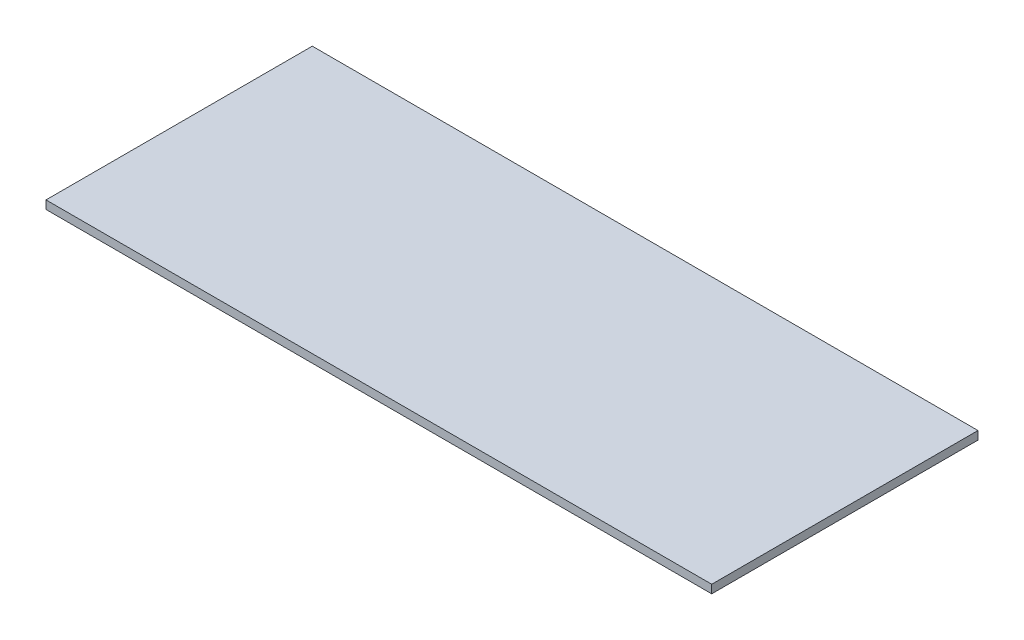
ISO-10303-21;
HEADER;
FILE_DESCRIPTION(('STEP AP214'),'2;1');
FILE_NAME('part.step','',(''),(''),'','','');
FILE_SCHEMA(('AUTOMOTIVE_DESIGN { 1 0 10303 214 1 1 1 1 }'));
ENDSEC;
DATA;
#1=APPLICATION_CONTEXT('core data for automotive mechanical design processes');
#2=APPLICATION_PROTOCOL_DEFINITION('international standard','automotive_design',2000,#1);
#3=PRODUCT_CONTEXT('',#1,'mechanical');
#4=PRODUCT('Part','Part','',(#3));
#5=PRODUCT_RELATED_PRODUCT_CATEGORY('part','',(#4));
#6=PRODUCT_DEFINITION_FORMATION('','',#4);
#7=PRODUCT_DEFINITION_CONTEXT('part definition',#1,'design');
#8=PRODUCT_DEFINITION('design','',#6,#7);
#9=PRODUCT_DEFINITION_SHAPE('','',#8);
#10=(LENGTH_UNIT() NAMED_UNIT(*) SI_UNIT(.MILLI.,.METRE.));
#11=(NAMED_UNIT(*) PLANE_ANGLE_UNIT() SI_UNIT($,.RADIAN.));
#12=(NAMED_UNIT(*) SI_UNIT($,.STERADIAN.) SOLID_ANGLE_UNIT());
#13=UNCERTAINTY_MEASURE_WITH_UNIT(LENGTH_MEASURE(1.E-05),#10,'distance_accuracy_value','');
#14=(GEOMETRIC_REPRESENTATION_CONTEXT(3) GLOBAL_UNCERTAINTY_ASSIGNED_CONTEXT((#13)) GLOBAL_UNIT_ASSIGNED_CONTEXT((#10,
#11,#12)) REPRESENTATION_CONTEXT('',''));
#15=CARTESIAN_POINT('',(0.,0.,0.));
#16=DIRECTION('',(0.,0.,1.));
#17=DIRECTION('',(1.,0.,0.));
#18=AXIS2_PLACEMENT_3D('',#15,#16,#17);
#19=CARTESIAN_POINT('',(254.,6.35,-101.6));
#20=DIRECTION('',(-1.,0.,0.));
#21=DIRECTION('',(0.,0.,1.));
#22=AXIS2_PLACEMENT_3D('',#19,#20,#21);
#23=PLANE('',#22);
#24=DIRECTION('',(0.,0.,-1.));
#25=VECTOR('',#24,1.);
#26=CARTESIAN_POINT('',(254.,0.,-101.6));
#27=LINE('',#26,#25);
#28=CARTESIAN_POINT('',(254.,0.,101.6));
#29=VERTEX_POINT('',#28);
#30=CARTESIAN_POINT('',(254.,0.,-101.6));
#31=VERTEX_POINT('',#30);
#32=EDGE_CURVE('E97',#29,#31,#27,.T.);
#33=ORIENTED_EDGE('',*,*,#32,.T.);
#34=DIRECTION('',(0.,-1.,0.));
#35=VECTOR('',#34,1.);
#36=CARTESIAN_POINT('',(254.,6.35,-101.6));
#37=LINE('',#36,#35);
#38=CARTESIAN_POINT('',(254.,6.35,-101.6));
#39=VERTEX_POINT('',#38);
#40=EDGE_CURVE('E11',#39,#31,#37,.T.);
#41=ORIENTED_EDGE('',*,*,#40,.F.);
#42=DIRECTION('',(0.,0.,-1.));
#43=VECTOR('',#42,1.);
#44=CARTESIAN_POINT('',(254.,6.35,-101.6));
#45=LINE('',#44,#43);
#46=CARTESIAN_POINT('',(254.,6.35,101.6));
#47=VERTEX_POINT('',#46);
#48=EDGE_CURVE('E85',#47,#39,#45,.T.);
#49=ORIENTED_EDGE('',*,*,#48,.F.);
#50=DIRECTION('',(0.,-1.,0.));
#51=VECTOR('',#50,1.);
#52=CARTESIAN_POINT('',(254.,6.35,101.6));
#53=LINE('',#52,#51);
#54=EDGE_CURVE('E93',#47,#29,#53,.T.);
#55=ORIENTED_EDGE('',*,*,#54,.T.);
#56=EDGE_LOOP('',(#33,#41,#49,#55));
#57=FACE_BOUND('',#56,.T.);
#58=ADVANCED_FACE('F34',(#57),#23,.F.);
#59=CARTESIAN_POINT('',(-254.,6.35,-101.6));
#60=DIRECTION('',(0.,0.,1.));
#61=DIRECTION('',(1.,0.,0.));
#62=AXIS2_PLACEMENT_3D('',#59,#60,#61);
#63=PLANE('',#62);
#64=DIRECTION('',(-1.,0.,0.));
#65=VECTOR('',#64,1.);
#66=CARTESIAN_POINT('',(-254.,0.,-101.6));
#67=LINE('',#66,#65);
#68=CARTESIAN_POINT('',(-254.,0.,-101.6));
#69=VERTEX_POINT('',#68);
#70=EDGE_CURVE('E89',#31,#69,#67,.T.);
#71=ORIENTED_EDGE('',*,*,#70,.T.);
#72=DIRECTION('',(0.,-1.,0.));
#73=VECTOR('',#72,1.);
#74=CARTESIAN_POINT('',(-254.,6.35,-101.6));
#75=LINE('',#74,#73);
#76=CARTESIAN_POINT('',(-254.,6.35,-101.6));
#77=VERTEX_POINT('',#76);
#78=EDGE_CURVE('E42',#77,#69,#75,.T.);
#79=ORIENTED_EDGE('',*,*,#78,.F.);
#80=DIRECTION('',(-1.,0.,0.));
#81=VECTOR('',#80,1.);
#82=CARTESIAN_POINT('',(-254.,6.35,-101.6));
#83=LINE('',#82,#81);
#84=EDGE_CURVE('E80',#39,#77,#83,.T.);
#85=ORIENTED_EDGE('',*,*,#84,.F.);
#86=ORIENTED_EDGE('',*,*,#40,.T.);
#87=EDGE_LOOP('',(#71,#79,#85,#86));
#88=FACE_BOUND('',#87,.T.);
#89=ADVANCED_FACE('F88',(#88),#63,.F.);
#90=CARTESIAN_POINT('',(-254.,6.35,-101.6));
#91=DIRECTION('',(1.,0.,0.));
#92=DIRECTION('',(0.,0.,-1.));
#93=AXIS2_PLACEMENT_3D('',#90,#91,#92);
#94=PLANE('',#93);
#95=DIRECTION('',(0.,0.,1.));
#96=VECTOR('',#95,1.);
#97=CARTESIAN_POINT('',(-254.,0.,-101.6));
#98=LINE('',#97,#96);
#99=CARTESIAN_POINT('',(-254.,0.,101.6));
#100=VERTEX_POINT('',#99);
#101=EDGE_CURVE('E67',#69,#100,#98,.T.);
#102=ORIENTED_EDGE('',*,*,#101,.T.);
#103=DIRECTION('',(0.,-1.,0.));
#104=VECTOR('',#103,1.);
#105=CARTESIAN_POINT('',(-254.,6.35,101.6));
#106=LINE('',#105,#104);
#107=CARTESIAN_POINT('',(-254.,6.35,101.6));
#108=VERTEX_POINT('',#107);
#109=EDGE_CURVE('E90',#108,#100,#106,.T.);
#110=ORIENTED_EDGE('',*,*,#109,.F.);
#111=DIRECTION('',(0.,0.,1.));
#112=VECTOR('',#111,1.);
#113=CARTESIAN_POINT('',(-254.,6.35,-101.6));
#114=LINE('',#113,#112);
#115=EDGE_CURVE('E83',#77,#108,#114,.T.);
#116=ORIENTED_EDGE('',*,*,#115,.F.);
#117=ORIENTED_EDGE('',*,*,#78,.T.);
#118=EDGE_LOOP('',(#102,#110,#116,#117));
#119=FACE_BOUND('',#118,.T.);
#120=ADVANCED_FACE('F91',(#119),#94,.F.);
#121=CARTESIAN_POINT('',(-254.,6.35,101.6));
#122=DIRECTION('',(0.,0.,-1.));
#123=DIRECTION('',(-1.,0.,0.));
#124=AXIS2_PLACEMENT_3D('',#121,#122,#123);
#125=PLANE('',#124);
#126=DIRECTION('',(1.,0.,0.));
#127=VECTOR('',#126,1.);
#128=CARTESIAN_POINT('',(-254.,0.,101.6));
#129=LINE('',#128,#127);
#130=EDGE_CURVE('E73',#100,#29,#129,.T.);
#131=ORIENTED_EDGE('',*,*,#130,.T.);
#132=ORIENTED_EDGE('',*,*,#54,.F.);
#133=DIRECTION('',(1.,0.,0.));
#134=VECTOR('',#133,1.);
#135=CARTESIAN_POINT('',(-254.,6.35,101.6));
#136=LINE('',#135,#134);
#137=EDGE_CURVE('E50',#108,#47,#136,.T.);
#138=ORIENTED_EDGE('',*,*,#137,.F.);
#139=ORIENTED_EDGE('',*,*,#109,.T.);
#140=EDGE_LOOP('',(#131,#132,#138,#139));
#141=FACE_BOUND('',#140,.T.);
#142=ADVANCED_FACE('F104',(#141),#125,.F.);
#143=CARTESIAN_POINT('',(0.,6.35,0.));
#144=DIRECTION('',(0.,1.,0.));
#145=DIRECTION('',(0.,0.,1.));
#146=AXIS2_PLACEMENT_3D('',#143,#144,#145);
#147=PLANE('',#146);
#148=ORIENTED_EDGE('',*,*,#48,.T.);
#149=ORIENTED_EDGE('',*,*,#84,.T.);
#150=ORIENTED_EDGE('',*,*,#115,.T.);
#151=ORIENTED_EDGE('',*,*,#137,.T.);
#152=EDGE_LOOP('',(#148,#149,#150,#151));
#153=FACE_BOUND('',#152,.T.);
#154=ADVANCED_FACE('F81',(#153),#147,.T.);
#155=CARTESIAN_POINT('',(0.,0.,0.));
#156=DIRECTION('',(0.,1.,0.));
#157=DIRECTION('',(0.,0.,1.));
#158=AXIS2_PLACEMENT_3D('',#155,#156,#157);
#159=PLANE('',#158);
#160=ORIENTED_EDGE('',*,*,#32,.F.);
#161=ORIENTED_EDGE('',*,*,#130,.F.);
#162=ORIENTED_EDGE('',*,*,#101,.F.);
#163=ORIENTED_EDGE('',*,*,#70,.F.);
#164=EDGE_LOOP('',(#160,#161,#162,#163));
#165=FACE_BOUND('',#164,.T.);
#166=ADVANCED_FACE('F107',(#165),#159,.F.);
#167=CLOSED_SHELL('',(#58,#89,#120,#142,#154,#166));
#168=MANIFOLD_SOLID_BREP('B2',#167);
#169=ADVANCED_BREP_SHAPE_REPRESENTATION('',(#18,#168),#14);
#170=SHAPE_DEFINITION_REPRESENTATION(#9,#169);
ENDSEC;
END-ISO-10303-21;
